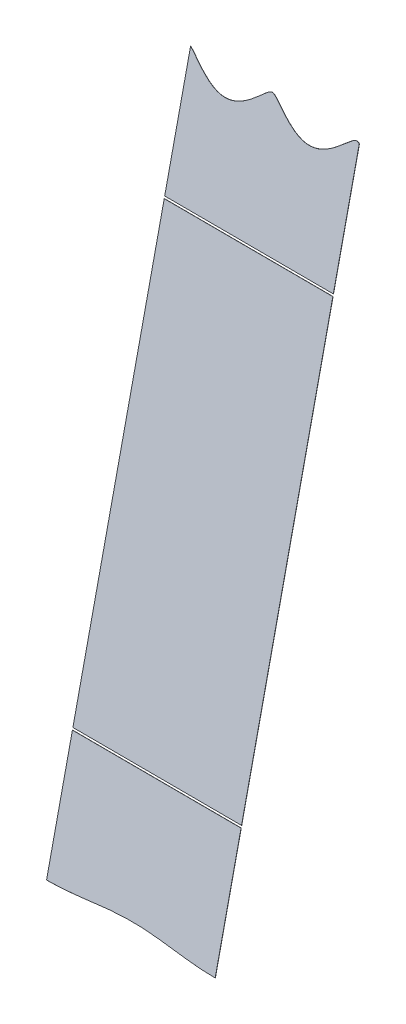
ISO-10303-21;
HEADER;
FILE_DESCRIPTION(('STEP AP214'),'2;1');
FILE_NAME('part.step','',(''),(''),'','','');
FILE_SCHEMA(('AUTOMOTIVE_DESIGN { 1 0 10303 214 1 1 1 1 }'));
ENDSEC;
DATA;
#1=APPLICATION_CONTEXT('core data for automotive mechanical design processes');
#2=APPLICATION_PROTOCOL_DEFINITION('international standard','automotive_design',2000,#1);
#3=PRODUCT_CONTEXT('',#1,'mechanical');
#4=PRODUCT('Part','Part','',(#3));
#5=PRODUCT_RELATED_PRODUCT_CATEGORY('part','',(#4));
#6=PRODUCT_DEFINITION_FORMATION('','',#4);
#7=PRODUCT_DEFINITION_CONTEXT('part definition',#1,'design');
#8=PRODUCT_DEFINITION('design','',#6,#7);
#9=PRODUCT_DEFINITION_SHAPE('','',#8);
#10=(LENGTH_UNIT() NAMED_UNIT(*) SI_UNIT(.MILLI.,.METRE.));
#11=(NAMED_UNIT(*) PLANE_ANGLE_UNIT() SI_UNIT($,.RADIAN.));
#12=(NAMED_UNIT(*) SI_UNIT($,.STERADIAN.) SOLID_ANGLE_UNIT());
#13=UNCERTAINTY_MEASURE_WITH_UNIT(LENGTH_MEASURE(1.E-05),#10,'distance_accuracy_value','');
#14=(GEOMETRIC_REPRESENTATION_CONTEXT(3) GLOBAL_UNCERTAINTY_ASSIGNED_CONTEXT((#13)) GLOBAL_UNIT_ASSIGNED_CONTEXT((#10,
#11,#12)) REPRESENTATION_CONTEXT('',''));
#15=CARTESIAN_POINT('',(0.,0.,0.));
#16=DIRECTION('',(0.,0.,1.));
#17=DIRECTION('',(1.,0.,0.));
#18=AXIS2_PLACEMENT_3D('',#15,#16,#17);
#19=CARTESIAN_POINT('',(4203.15583982929,-2777.77441756719,1018.08170440658));
#20=DIRECTION('',(-0.00396825396824498,0.216307580433428,0.976317204400025));
#21=DIRECTION('',(0.,-0.976324891543631,0.216309283555555));
#22=AXIS2_PLACEMENT_3D('',#19,#20,#21);
#23=PLANE('',#22);
#24=DIRECTION('',(0.999992126449225,0.000858370172837925,0.00387430512516479));
#25=VECTOR('',#24,1.);
#26=CARTESIAN_POINT('',(1000.56833114507,323.564899174338,317.948713594979));
#27=LINE('',#26,#25);
#28=CARTESIAN_POINT('',(1000.56833114507,323.564899174338,317.948713594979));
#29=VERTEX_POINT('',#28);
#30=CARTESIAN_POINT('',(1079.9496031746,323.633038227026,318.256263285554));
#31=VERTEX_POINT('',#30);
#32=EDGE_CURVE('E14',#29,#31,#27,.T.);
#33=ORIENTED_EDGE('',*,*,#32,.F.);
#34=DIRECTION('',(0.,0.976324891543631,-0.216309283555555));
#35=VECTOR('',#34,1.);
#36=CARTESIAN_POINT('',(1000.56833114507,268.76455418902,330.089982823126));
#37=LINE('',#36,#35);
#38=CARTESIAN_POINT('',(1000.56833114507,268.76455418902,330.089982823126));
#39=VERTEX_POINT('',#38);
#40=EDGE_CURVE('E112',#39,#29,#37,.T.);
#41=ORIENTED_EDGE('',*,*,#40,.F.);
#42=CARTESIAN_POINT('',(1000.56833114507,268.76455418902,330.089982823125));
#43=CARTESIAN_POINT('',(1001.80451108967,268.766137941085,330.094656405003));
#44=CARTESIAN_POINT('',(1004.27681417362,268.820556080355,330.092648523236));
#45=CARTESIAN_POINT('',(1006.74808644245,268.924179126641,330.079734877573));
#46=CARTESIAN_POINT('',(1008.62287459543,269.037184915164,330.062318024643));
#47=CARTESIAN_POINT('',(1009.86153110381,269.12220138551,330.048516768932));
#48=CARTESIAN_POINT('',(1011.09985735074,269.216740678427,330.032604345599));
#49=CARTESIAN_POINT('',(1012.33769195354,269.319886536673,330.014783099721));
#50=CARTESIAN_POINT('',(1013.5747575011,269.430627012192,329.995276105517));
#51=CARTESIAN_POINT('',(1014.81053089588,269.547850016306,329.974327625227));
#52=CARTESIAN_POINT('',(1016.04389008025,269.670315619974,329.952207810232));
#53=CARTESIAN_POINT('',(1017.27190545426,269.796537301001,329.929234098984));
#54=CARTESIAN_POINT('',(1017.93298440153,269.86614673832,329.916498771009));
#55=CARTESIAN_POINT('',(1018.48373287821,269.924138740219,329.905888899811));
#56=CARTESIAN_POINT('',(1019.44800225942,270.027127587642,329.886990531006));
#57=CARTESIAN_POINT('',(1019.79348296472,270.064155553608,329.880191025152));
#58=CARTESIAN_POINT('',(1019.99108662077,270.085334338236,329.876301930347));
#59=CARTESIAN_POINT('',(1020.81929925612,270.174197957099,329.859980066678));
#60=CARTESIAN_POINT('',(1021.03381534018,270.197184952217,329.855759095282));
#61=CARTESIAN_POINT('',(1021.3773364207,270.23399579293,329.848999729609));
#62=CARTESIAN_POINT('',(1022.34159633172,270.336943838154,329.830110362227));
#63=CARTESIAN_POINT('',(1022.89431390338,270.395097781947,329.819472615468));
#64=CARTESIAN_POINT('',(1023.55461173951,270.464570737428,329.806764350837));
#65=CARTESIAN_POINT('',(1024.78295420149,270.590675916015,329.783817780696));
#66=CARTESIAN_POINT('',(1026.0164477646,270.712956120907,329.761739587838));
#67=CARTESIAN_POINT('',(1027.25228917246,270.829940287584,329.740844299524));
#68=CARTESIAN_POINT('',(1028.48939363135,270.940394847723,329.721400809347));
#69=CARTESIAN_POINT('',(1029.72725231253,271.04321203544,329.703652479808));
#70=CARTESIAN_POINT('',(1030.96559450374,271.137383799183,329.687821549065));
#71=CARTESIAN_POINT('',(1032.20426200112,271.221997772257,329.674109513147));
#72=CARTESIAN_POINT('',(1034.07890567396,271.334338345117,329.656839454573));
#73=CARTESIAN_POINT('',(1036.55020914601,271.437000848378,329.644138748475));
#74=CARTESIAN_POINT('',(1039.02257540382,271.490398568754,329.642357201992));
#75=CARTESIAN_POINT('',(1041.49525979722,271.492522098307,329.651936982083));
#76=CARTESIAN_POINT('',(1043.96762612984,271.443370850032,329.672875632972));
#77=CARTESIAN_POINT('',(1046.43892970556,271.344952870979,329.704725235745));
#78=CARTESIAN_POINT('',(1048.3135730603,271.235831922349,329.736520997578));
#79=CARTESIAN_POINT('',(1049.55224050005,271.153345241628,329.759830882117));
#80=CARTESIAN_POINT('',(1050.79058274073,271.061300137031,329.785257157783));
#81=CARTESIAN_POINT('',(1052.02844161448,270.960608689617,329.812597105935));
#82=CARTESIAN_POINT('',(1053.26554607168,270.852278508502,329.841626384441));
#83=CARTESIAN_POINT('',(1054.50138753325,270.737416461405,329.872097694524));
#84=CARTESIAN_POINT('',(1055.73488141363,270.617254226591,329.903733743872));
#85=CARTESIAN_POINT('',(1056.9632244239,270.493258054187,329.936198284001));
#86=CARTESIAN_POINT('',(1057.6236204163,270.424908617498,329.954025605094));
#87=CARTESIAN_POINT('',(1058.17624196949,270.367713582552,329.968943566416));
#88=CARTESIAN_POINT('',(1059.14050184601,270.266421018689,329.99530464801));
#89=CARTESIAN_POINT('',(1059.48411897949,270.230189805863,330.004728476654));
#90=CARTESIAN_POINT('',(1059.69856399563,270.207578584645,330.010609711577));
#91=CARTESIAN_POINT('',(1060.52678791247,270.120135613342,330.033349432124));
#92=CARTESIAN_POINT('',(1060.72445135495,270.09928975265,330.038771334354));
#93=CARTESIAN_POINT('',(1061.06983660923,270.062864944878,330.048245241401));
#94=CARTESIAN_POINT('',(1062.03410575727,269.961531457687,330.074615427431));
#95=CARTESIAN_POINT('',(1062.58494991814,269.904474955457,330.089495471957));
#96=CARTESIAN_POINT('',(1063.24593076006,269.836010482999,330.107350656884));
#97=CARTESIAN_POINT('',(1064.473945407,269.711896779526,330.139839901926));
#98=CARTESIAN_POINT('',(1065.70730433606,269.591548181748,330.171516692337));
#99=CARTESIAN_POINT('',(1066.94307769533,269.476446214516,330.20204088103));
#100=CARTESIAN_POINT('',(1068.18014315778,269.36782891112,330.231133614307));
#101=CARTESIAN_POINT('',(1069.41797771056,269.266807459309,330.258546577603));
#102=CARTESIAN_POINT('',(1070.65630394372,269.17439333863,330.284054545422));
#103=CARTESIAN_POINT('',(1071.89496043202,269.091502538919,330.307453919875));
#104=CARTESIAN_POINT('',(1073.76974891639,268.981713979889,330.339398183752));
#105=CARTESIAN_POINT('',(1076.24102112307,268.882331596532,330.371461327248));
#106=CARTESIAN_POINT('',(1078.71337402659,268.832154755645,330.392627148329));
#107=CARTESIAN_POINT('',(1079.9496031746,268.832693241708,330.397532513699));
#108=B_SPLINE_CURVE_WITH_KNOTS('',2,(#42,#43,#44,#45,#46,#47,#48,#49,#50,#51,#52,#53,#54,#55,
#56,#57,#58,#59,#60,#61,#62,#63,#64,#65,#66,#67,#68,#69,#70,#71,#72,#73,#74,#75,#76,#77,#78,#79,
#80,#81,#82,#83,#84,#85,#86,#87,#88,#89,#90,#91,#92,#93,#94,#95,#96,#97,#98,#99,#100,#101,#102,
#103,#104,#105,#106,#107),.UNSPECIFIED.,.F.,.F.,(3,1,1,1,1,1,1,1,1,1,1,2,1,2,1,2,1,2,1,1,1,1,1,
1,1,1,1,1,1,1,1,1,1,1,1,1,1,1,1,2,1,2,1,2,1,2,1,1,1,1,1,1,1,1,1,1,3),(0.,0.03125,0.0625,0.09375,
0.109375,0.125,0.140625,0.15625,0.171875,0.1875,0.203125,0.21875,0.234375,0.2421875,0.25,
0.2578125,0.265625,0.28125,0.296875,0.3125,0.328125,0.34375,0.359375,0.375,0.390625,0.40625,
0.4375,0.46875,0.5,0.53125,0.5625,0.59375,0.609375,0.625,0.640625,0.65625,0.671875,0.6875,
0.703125,0.71875,0.734375,0.7421875,0.75,0.7578125,0.765625,0.78125,0.796875,0.8125,0.828125,
0.84375,0.859375,0.875,0.890625,0.90625,0.9375,0.96875,1.),.UNSPECIFIED.);
#109=CARTESIAN_POINT('',(1079.9496031746,268.832693241708,330.3975325137));
#110=VERTEX_POINT('',#109);
#111=EDGE_CURVE('E106',#39,#110,#108,.T.);
#112=ORIENTED_EDGE('',*,*,#111,.T.);
#113=DIRECTION('',(0.,0.976324891543631,-0.216309283555555));
#114=VECTOR('',#113,1.);
#115=CARTESIAN_POINT('',(1079.9496031746,268.832693241708,330.3975325137));
#116=LINE('',#115,#114);
#117=EDGE_CURVE('E100',#110,#31,#116,.T.);
#118=ORIENTED_EDGE('',*,*,#117,.T.);
#119=EDGE_LOOP('',(#33,#41,#112,#118));
#120=FACE_BOUND('',#119,.T.);
#121=ADVANCED_FACE('F53',(#120),#23,.T.);
#122=CARTESIAN_POINT('',(4203.15623665469,-2777.79604832523,1017.98407268614));
#123=DIRECTION('',(-0.00396825396824498,0.216307580433428,0.976317204400025));
#124=DIRECTION('',(0.,-0.976324891543631,0.216309283555555));
#125=AXIS2_PLACEMENT_3D('',#122,#123,#124);
#126=PLANE('',#125);
#127=DIRECTION('',(0.,0.976324891543631,-0.216309283555555));
#128=VECTOR('',#127,1.);
#129=CARTESIAN_POINT('',(1000.56872797047,268.742923430977,329.992351102686));
#130=LINE('',#129,#128);
#131=CARTESIAN_POINT('',(1000.56872797047,268.742923430977,329.992351102686));
#132=VERTEX_POINT('',#131);
#133=CARTESIAN_POINT('',(1000.56872797047,323.543268416294,317.85108187454));
#134=VERTEX_POINT('',#133);
#135=EDGE_CURVE('E56',#132,#134,#130,.T.);
#136=ORIENTED_EDGE('',*,*,#135,.T.);
#137=DIRECTION('',(0.999992126449225,0.000858370172837819,0.00387430512516431));
#138=VECTOR('',#137,1.);
#139=CARTESIAN_POINT('',(4203.15623665469,326.292295654258,330.258980767444));
#140=LINE('',#139,#138);
#141=CARTESIAN_POINT('',(1079.95,323.611407468991,318.15863156515));
#142=VERTEX_POINT('',#141);
#143=EDGE_CURVE('E71',#134,#142,#140,.T.);
#144=ORIENTED_EDGE('',*,*,#143,.T.);
#145=DIRECTION('',(0.,0.976324891543631,-0.216309283555555));
#146=VECTOR('',#145,1.);
#147=CARTESIAN_POINT('',(1079.95,268.811062483665,330.29990079326));
#148=LINE('',#147,#146);
#149=CARTESIAN_POINT('',(1079.95,268.811062483665,330.29990079326));
#150=VERTEX_POINT('',#149);
#151=EDGE_CURVE('E102',#150,#142,#148,.T.);
#152=ORIENTED_EDGE('',*,*,#151,.F.);
#153=CARTESIAN_POINT('',(1000.56872797047,268.742923430977,329.992351102685));
#154=CARTESIAN_POINT('',(1001.80490791507,268.744507183042,329.997024684563));
#155=CARTESIAN_POINT('',(1004.27721099901,268.798925322312,329.995016802796));
#156=CARTESIAN_POINT('',(1006.74848326784,268.902548368597,329.982103157133));
#157=CARTESIAN_POINT('',(1008.62327142083,269.015554157121,329.964686304203));
#158=CARTESIAN_POINT('',(1009.86192792921,269.100570627467,329.950885048492));
#159=CARTESIAN_POINT('',(1011.10025417613,269.195109920383,329.934972625159));
#160=CARTESIAN_POINT('',(1012.33808877894,269.29825577863,329.917151379281));
#161=CARTESIAN_POINT('',(1013.5751543265,269.408996254149,329.897644385077));
#162=CARTESIAN_POINT('',(1014.81092772128,269.526219258263,329.876695904787));
#163=CARTESIAN_POINT('',(1016.04428690564,269.648684861931,329.854576089792));
#164=CARTESIAN_POINT('',(1017.27230227966,269.774906542958,329.831602378544));
#165=CARTESIAN_POINT('',(1017.93338122693,269.844515980276,329.818867050569));
#166=CARTESIAN_POINT('',(1018.48412970361,269.902507982176,329.808257179371));
#167=CARTESIAN_POINT('',(1019.44839908481,270.005496829599,329.789358810566));
#168=CARTESIAN_POINT('',(1019.79387979012,270.042524795565,329.782559304712));
#169=CARTESIAN_POINT('',(1019.99148344617,270.063703580193,329.778670209907));
#170=CARTESIAN_POINT('',(1020.81969608152,270.152567199056,329.762348346238));
#171=CARTESIAN_POINT('',(1021.03421216558,270.175554194174,329.758127374842));
#172=CARTESIAN_POINT('',(1021.3777332461,270.212365034887,329.751368009169));
#173=CARTESIAN_POINT('',(1022.34199315712,270.315313080111,329.732478641787));
#174=CARTESIAN_POINT('',(1022.89471072877,270.373467023903,329.721840895028));
#175=CARTESIAN_POINT('',(1023.55500856491,270.442939979385,329.709132630397));
#176=CARTESIAN_POINT('',(1024.78335102689,270.569045157971,329.686186060256));
#177=CARTESIAN_POINT('',(1026.01684458999,270.691325362863,329.664107867398));
#178=CARTESIAN_POINT('',(1027.25268599786,270.80830952954,329.643212579084));
#179=CARTESIAN_POINT('',(1028.48979045675,270.91876408968,329.623769088907));
#180=CARTESIAN_POINT('',(1029.72764913793,271.021581277396,329.606020759368));
#181=CARTESIAN_POINT('',(1030.96599132914,271.11575304114,329.590189828625));
#182=CARTESIAN_POINT('',(1032.20465882652,271.200367014214,329.576477792706));
#183=CARTESIAN_POINT('',(1034.07930249935,271.312707587073,329.559207734133));
#184=CARTESIAN_POINT('',(1036.5506059714,271.415370090335,329.546507028035));
#185=CARTESIAN_POINT('',(1039.02297222922,271.46876781071,329.544725481552));
#186=CARTESIAN_POINT('',(1041.49565662262,271.470891340264,329.554305261643));
#187=CARTESIAN_POINT('',(1043.96802295524,271.421740091989,329.575243912532));
#188=CARTESIAN_POINT('',(1046.43932653096,271.323322112935,329.607093515305));
#189=CARTESIAN_POINT('',(1048.3139698857,271.214201164306,329.638889277138));
#190=CARTESIAN_POINT('',(1049.55263732545,271.131714483585,329.662199161677));
#191=CARTESIAN_POINT('',(1050.79097956613,271.039669378988,329.687625437343));
#192=CARTESIAN_POINT('',(1052.02883843988,270.938977931574,329.714965385495));
#193=CARTESIAN_POINT('',(1053.26594289708,270.830647750459,329.743994664001));
#194=CARTESIAN_POINT('',(1054.50178435864,270.715785703362,329.774465974084));
#195=CARTESIAN_POINT('',(1055.73527823902,270.595623468547,329.806102023432));
#196=CARTESIAN_POINT('',(1056.9636212493,270.471627296144,329.838566563561));
#197=CARTESIAN_POINT('',(1057.62401724169,270.403277859455,329.856393884654));
#198=CARTESIAN_POINT('',(1058.17663879489,270.346082824508,329.871311845976));
#199=CARTESIAN_POINT('',(1059.14089867141,270.244790260646,329.89767292757));
#200=CARTESIAN_POINT('',(1059.48451580489,270.20855904782,329.907096756214));
#201=CARTESIAN_POINT('',(1059.69896082103,270.185947826601,329.912977991137));
#202=CARTESIAN_POINT('',(1060.52718473787,270.098504855298,329.935717711684));
#203=CARTESIAN_POINT('',(1060.72484818035,270.077658994607,329.941139613914));
#204=CARTESIAN_POINT('',(1061.07023343463,270.041234186834,329.950613520961));
#205=CARTESIAN_POINT('',(1062.03450258267,269.939900699643,329.976983706991));
#206=CARTESIAN_POINT('',(1062.58534674354,269.882844197413,329.991863751517));
#207=CARTESIAN_POINT('',(1063.24632758546,269.814379724955,330.009718936444));
#208=CARTESIAN_POINT('',(1064.47434223239,269.690266021483,330.042208181486));
#209=CARTESIAN_POINT('',(1065.70770116146,269.569917423705,330.073884971897));
#210=CARTESIAN_POINT('',(1066.94347452073,269.454815456472,330.10440916059));
#211=CARTESIAN_POINT('',(1068.18053998318,269.346198153077,330.133501893867));
#212=CARTESIAN_POINT('',(1069.41837453596,269.245176701266,330.160914857163));
#213=CARTESIAN_POINT('',(1070.65670076911,269.152762580587,330.186422824981));
#214=CARTESIAN_POINT('',(1071.89535725742,269.069871780876,330.209822199434));
#215=CARTESIAN_POINT('',(1073.77014574178,268.960083221845,330.241766463312));
#216=CARTESIAN_POINT('',(1076.24141794847,268.860700838489,330.273829606808));
#217=CARTESIAN_POINT('',(1078.71377085199,268.810523997602,330.294995427889));
#218=CARTESIAN_POINT('',(1079.95,268.811062483665,330.299900793259));
#219=B_SPLINE_CURVE_WITH_KNOTS('',2,(#153,#154,#155,#156,#157,#158,#159,#160,#161,#162,#163,
#164,#165,#166,#167,#168,#169,#170,#171,#172,#173,#174,#175,#176,#177,#178,#179,#180,#181,#182,
#183,#184,#185,#186,#187,#188,#189,#190,#191,#192,#193,#194,#195,#196,#197,#198,#199,#200,#201,
#202,#203,#204,#205,#206,#207,#208,#209,#210,#211,#212,#213,#214,#215,#216,#217,#218),
.UNSPECIFIED.,.F.,.F.,(3,1,1,1,1,1,1,1,1,1,1,2,1,2,1,2,1,2,1,1,1,1,1,1,1,1,1,1,1,1,1,1,1,1,1,1,
1,1,1,2,1,2,1,2,1,2,1,1,1,1,1,1,1,1,1,1,3),(0.,0.03125,0.0625,0.09375,0.109375,0.125,0.140625,
0.15625,0.171875,0.1875,0.203125,0.21875,0.234375,0.2421875,0.25,0.2578125,0.265625,0.28125,
0.296875,0.3125,0.328125,0.34375,0.359375,0.375,0.390625,0.40625,0.4375,0.46875,0.5,0.53125,
0.5625,0.59375,0.609375,0.625,0.640625,0.65625,0.671875,0.6875,0.703125,0.71875,0.734375,
0.7421875,0.75,0.7578125,0.765625,0.78125,0.796875,0.8125,0.828125,0.84375,0.859375,0.875,
0.890625,0.90625,0.9375,0.96875,1.),.UNSPECIFIED.);
#220=EDGE_CURVE('E113',#132,#150,#219,.T.);
#221=ORIENTED_EDGE('',*,*,#220,.F.);
#222=EDGE_LOOP('',(#136,#144,#152,#221));
#223=FACE_BOUND('',#222,.T.);
#224=ADVANCED_FACE('F138',(#223),#126,.F.);
#225=CARTESIAN_POINT('',(1079.9496031746,268.832693241708,330.3975325137));
#226=DIRECTION('',(-0.999992126449225,-0.000858370172840623,-0.00387430512518148));
#227=DIRECTION('',(-0.00387430655247502,0.,0.999992494846205));
#228=AXIS2_PLACEMENT_3D('',#225,#226,#227);
#229=PLANE('',#228);
#230=ORIENTED_EDGE('',*,*,#151,.T.);
#231=DIRECTION('',(-0.00396825396824498,0.216307580433428,0.976317204400025));
#232=VECTOR('',#231,1.);
#233=CARTESIAN_POINT('',(1079.98928571429,321.469962422692,308.493091241553));
#234=LINE('',#233,#232);
#235=EDGE_CURVE('E90',#142,#31,#234,.T.);
#236=ORIENTED_EDGE('',*,*,#235,.T.);
#237=ORIENTED_EDGE('',*,*,#117,.F.);
#238=DIRECTION('',(0.00396825396826235,-0.216307580433427,-0.976317204400025));
#239=VECTOR('',#238,1.);
#240=CARTESIAN_POINT('',(1079.9496031746,268.832693241708,330.3975325137));
#241=LINE('',#240,#239);
#242=EDGE_CURVE('E103',#110,#150,#241,.T.);
#243=ORIENTED_EDGE('',*,*,#242,.T.);
#244=EDGE_LOOP('',(#230,#236,#237,#243));
#245=FACE_BOUND('',#244,.T.);
#246=ADVANCED_FACE('F98',(#245),#229,.F.);
#247=CARTESIAN_POINT('',(1000.56833114507,268.76455418902,330.089982823126));
#248=DIRECTION('',(-0.999992126449225,-0.000858370172842012,-0.00387430512518117));
#249=DIRECTION('',(-0.00387430655247472,0.,0.999992494846205));
#250=AXIS2_PLACEMENT_3D('',#247,#248,#249);
#251=PLANE('',#250);
#252=DIRECTION('',(-0.00396825396826235,0.216307580433428,0.976317204400025));
#253=VECTOR('',#252,1.);
#254=CARTESIAN_POINT('',(1000.56833114507,323.564899174338,317.94871359498));
#255=LINE('',#254,#253);
#256=EDGE_CURVE('E62',#134,#29,#255,.T.);
#257=ORIENTED_EDGE('',*,*,#256,.F.);
#258=ORIENTED_EDGE('',*,*,#135,.F.);
#259=DIRECTION('',(0.00396825396826235,-0.216307580433427,-0.976317204400025));
#260=VECTOR('',#259,1.);
#261=CARTESIAN_POINT('',(1000.56833114507,268.76455418902,330.089982823126));
#262=LINE('',#261,#260);
#263=EDGE_CURVE('E145',#39,#132,#262,.T.);
#264=ORIENTED_EDGE('',*,*,#263,.F.);
#265=ORIENTED_EDGE('',*,*,#40,.T.);
#266=EDGE_LOOP('',(#257,#258,#264,#265));
#267=FACE_BOUND('',#266,.T.);
#268=ADVANCED_FACE('F130',(#267),#251,.T.);
#269=DIRECTION('',(0.00396825396826235,-0.216307580433427,-0.976317204400025));
#270=VECTOR('',#269,1.);
#271=SURFACE_OF_LINEAR_EXTRUSION('',#108,#270);
#272=ORIENTED_EDGE('',*,*,#220,.T.);
#273=ORIENTED_EDGE('',*,*,#242,.F.);
#274=ORIENTED_EDGE('',*,*,#111,.F.);
#275=ORIENTED_EDGE('',*,*,#263,.T.);
#276=EDGE_LOOP('',(#272,#273,#274,#275));
#277=FACE_BOUND('',#276,.T.);
#278=ADVANCED_FACE('F127',(#277),#271,.F.);
#279=CARTESIAN_POINT('',(1000.60801368475,321.401823370003,308.185541550979));
#280=DIRECTION('',(0.,-0.976324891543631,0.216309283555555));
#281=DIRECTION('',(0.,-0.216309283555555,-0.976324891543631));
#282=AXIS2_PLACEMENT_3D('',#279,#280,#281);
#283=PLANE('',#282);
#284=ORIENTED_EDGE('',*,*,#256,.T.);
#285=ORIENTED_EDGE('',*,*,#32,.T.);
#286=ORIENTED_EDGE('',*,*,#235,.F.);
#287=ORIENTED_EDGE('',*,*,#143,.F.);
#288=EDGE_LOOP('',(#284,#285,#286,#287));
#289=FACE_BOUND('',#288,.T.);
#290=ADVANCED_FACE('F89',(#289),#283,.F.);
#291=CLOSED_SHELL('',(#121,#224,#246,#268,#278,#290));
#292=MANIFOLD_SOLID_BREP('B2',#291);
#293=CARTESIAN_POINT('',(1000.56833114507,268.76455418902,330.089982823126));
#294=DIRECTION('',(-0.999992126449225,-0.000858370172842012,-0.00387430512518117));
#295=DIRECTION('',(-0.00387430655247472,0.,0.999992494846205));
#296=AXIS2_PLACEMENT_3D('',#293,#294,#295);
#297=PLANE('',#296);
#298=DIRECTION('',(-0.00396825396824498,0.216307580433428,0.976317204400025));
#299=VECTOR('',#298,1.);
#300=CARTESIAN_POINT('',(1000.60801368475,516.666801678729,264.923684839868));
#301=LINE('',#300,#299);
#302=CARTESIAN_POINT('',(1000.56872797047,518.808246725021,274.589225163429));
#303=VERTEX_POINT('',#302);
#304=CARTESIAN_POINT('',(1000.56833114507,518.829877483064,274.686856883869));
#305=VERTEX_POINT('',#304);
#306=EDGE_CURVE('E244',#303,#305,#301,.T.);
#307=ORIENTED_EDGE('',*,*,#306,.T.);
#308=DIRECTION('',(0.,0.976324891543631,-0.216309283555555));
#309=VECTOR('',#308,1.);
#310=CARTESIAN_POINT('',(1000.56833114507,268.76455418902,330.089982823126));
#311=LINE('',#310,#309);
#312=CARTESIAN_POINT('',(1000.56833114507,573.630222468382,262.545587655723));
#313=VERTEX_POINT('',#312);
#314=EDGE_CURVE('E240',#305,#313,#311,.T.);
#315=ORIENTED_EDGE('',*,*,#314,.T.);
#316=DIRECTION('',(0.00396825396826235,-0.216307580433427,-0.976317204400025));
#317=VECTOR('',#316,1.);
#318=CARTESIAN_POINT('',(1000.56833114507,573.630222468382,262.545587655723));
#319=LINE('',#318,#317);
#320=CARTESIAN_POINT('',(1000.56872797047,573.608591710338,262.447955935283));
#321=VERTEX_POINT('',#320);
#322=EDGE_CURVE('E242',#313,#321,#319,.T.);
#323=ORIENTED_EDGE('',*,*,#322,.T.);
#324=DIRECTION('',(0.,0.976324891543631,-0.216309283555555));
#325=VECTOR('',#324,1.);
#326=CARTESIAN_POINT('',(1000.56872797047,268.742923430977,329.992351102686));
#327=LINE('',#326,#325);
#328=EDGE_CURVE('E201',#303,#321,#327,.T.);
#329=ORIENTED_EDGE('',*,*,#328,.F.);
#330=EDGE_LOOP('',(#307,#315,#323,#329));
#331=FACE_BOUND('',#330,.T.);
#332=ADVANCED_FACE('F198',(#331),#297,.T.);
#333=CARTESIAN_POINT('',(1079.9496031746,268.832693241708,330.3975325137));
#334=DIRECTION('',(-0.999992126449225,-0.000858370172840623,-0.00387430512518148));
#335=DIRECTION('',(-0.00387430655247502,0.,0.999992494846205));
#336=AXIS2_PLACEMENT_3D('',#333,#334,#335);
#337=PLANE('',#336);
#338=DIRECTION('',(0.,0.976324891543631,-0.216309283555555));
#339=VECTOR('',#338,1.);
#340=CARTESIAN_POINT('',(1079.9496031746,268.832693241708,330.3975325137));
#341=LINE('',#340,#339);
#342=CARTESIAN_POINT('',(1079.9496031746,518.898016535752,274.994406574443));
#343=VERTEX_POINT('',#342);
#344=CARTESIAN_POINT('',(1079.9496031746,573.761493141126,262.839150244645));
#345=VERTEX_POINT('',#344);
#346=EDGE_CURVE('E258',#343,#345,#341,.T.);
#347=ORIENTED_EDGE('',*,*,#346,.F.);
#348=DIRECTION('',(-0.00396825396824498,0.216307580433428,0.976317204400025));
#349=VECTOR('',#348,1.);
#350=CARTESIAN_POINT('',(1079.98928571429,516.734940731418,265.231234530442));
#351=LINE('',#350,#349);
#352=CARTESIAN_POINT('',(1079.95,518.876385777709,274.896774854003));
#353=VERTEX_POINT('',#352);
#354=EDGE_CURVE('E207',#353,#343,#351,.T.);
#355=ORIENTED_EDGE('',*,*,#354,.F.);
#356=DIRECTION('',(0.,0.976324891543631,-0.216309283555555));
#357=VECTOR('',#356,1.);
#358=CARTESIAN_POINT('',(1079.95,268.811062483665,330.29990079326));
#359=LINE('',#358,#357);
#360=CARTESIAN_POINT('',(1079.95,573.739862383083,262.741518524205));
#361=VERTEX_POINT('',#360);
#362=EDGE_CURVE('E254',#353,#361,#359,.T.);
#363=ORIENTED_EDGE('',*,*,#362,.T.);
#364=DIRECTION('',(0.00396825396826235,-0.216307580433427,-0.976317204400025));
#365=VECTOR('',#364,1.);
#366=CARTESIAN_POINT('',(1079.9496031746,573.761493141126,262.839150244645));
#367=LINE('',#366,#365);
#368=EDGE_CURVE('E260',#345,#361,#367,.T.);
#369=ORIENTED_EDGE('',*,*,#368,.F.);
#370=EDGE_LOOP('',(#347,#355,#363,#369));
#371=FACE_BOUND('',#370,.T.);
#372=ADVANCED_FACE('F283',(#371),#337,.F.);
#373=CARTESIAN_POINT('',(4203.15583982929,-2777.77441756719,1018.08170440658));
#374=DIRECTION('',(-0.00396825396824498,0.216307580433428,0.976317204400025));
#375=DIRECTION('',(0.,-0.976324891543631,0.216309283555555));
#376=AXIS2_PLACEMENT_3D('',#373,#374,#375);
#377=PLANE('',#376);
#378=DIRECTION('',(-0.999992126449225,-0.000858370172837226,-0.00387430512516409));
#379=VECTOR('',#378,1.);
#380=CARTESIAN_POINT('',(1000.56833114507,518.829877483064,274.686856883869));
#381=LINE('',#380,#379);
#382=EDGE_CURVE('E51',#343,#305,#381,.T.);
#383=ORIENTED_EDGE('',*,*,#382,.F.);
#384=ORIENTED_EDGE('',*,*,#346,.T.);
#385=CARTESIAN_POINT('',(1000.56833114507,573.630222468382,262.545587655723));
#386=CARTESIAN_POINT('',(1000.83581871435,573.45884938545,262.584643359501));
#387=CARTESIAN_POINT('',(1001.41635312954,573.022989631584,262.683569688289));
#388=CARTESIAN_POINT('',(1001.72655396512,572.77204054975,262.740429430338));
#389=CARTESIAN_POINT('',(1002.15259517906,572.427377869315,262.818522687186));
#390=CARTESIAN_POINT('',(1002.82209324366,571.854700810702,262.948123114895));
#391=CARTESIAN_POINT('',(1003.02584584922,571.680414357896,262.98756523762));
#392=CARTESIAN_POINT('',(1003.3633734876,571.389867818325,263.053309049241));
#393=CARTESIAN_POINT('',(1003.81803446848,570.998491943725,263.141868155161));
#394=CARTESIAN_POINT('',(1003.90451317117,570.9241731488,263.158685320824));
#395=CARTESIAN_POINT('',(1004.53485760153,570.382462450189,263.28126586817));
#396=CARTESIAN_POINT('',(1004.99472563613,569.99512003004,263.368952507788));
#397=CARTESIAN_POINT('',(1005.58318741802,569.499464334025,263.481159124286));
#398=CARTESIAN_POINT('',(1006.6847930713,568.605754729029,263.683642100496));
#399=CARTESIAN_POINT('',(1007.22528516729,568.189740836609,263.778008734603));
#400=CARTESIAN_POINT('',(1008.43796708344,567.256346013715,263.989735624823));
#401=CARTESIAN_POINT('',(1009.5466714323,566.525869572087,264.156082393427));
#402=CARTESIAN_POINT('',(1010.82812431749,565.681576731845,264.348347848855));
#403=CARTESIAN_POINT('',(1012.03811150665,565.062878085765,264.49034139664));
#404=CARTESIAN_POINT('',(1013.39769391619,564.367687422962,264.649890135309));
#405=CARTESIAN_POINT('',(1014.70788893383,563.936002747191,264.750857171288));
#406=CARTESIAN_POINT('',(1016.13798270449,563.464813681897,264.861063917042));
#407=CARTESIAN_POINT('',(1018.99183636331,563.12338835439,264.948307798656));
#408=CARTESIAN_POINT('',(1021.85304862367,563.415001434388,264.895329009982));
#409=CARTESIAN_POINT('',(1023.28895874417,563.866712673095,264.80108657663));
#410=CARTESIAN_POINT('',(1024.60613108407,564.281071163054,264.714637205821));
#411=CARTESIAN_POINT('',(1025.96963842982,564.962846145494,264.569128806731));
#412=CARTESIAN_POINT('',(1027.18716701752,565.571629467482,264.439198714169));
#413=CARTESIAN_POINT('',(1028.47354886203,566.409931760793,264.258697489686));
#414=CARTESIAN_POINT('',(1029.59081076576,567.138022894952,264.101926665724));
#415=CARTESIAN_POINT('',(1030.80956581201,568.07233820212,263.899878445106));
#416=CARTESIAN_POINT('',(1031.35570380357,568.491015512968,263.809338340475));
#417=CARTESIAN_POINT('',(1032.46196227087,569.387283092976,263.615262525519));
#418=CARTESIAN_POINT('',(1033.04702349497,569.880224484031,263.508427075319));
#419=CARTESIAN_POINT('',(1033.5106697712,570.270868114042,263.423762673349));
#420=CARTESIAN_POINT('',(1034.13202876131,570.805819093123,263.30776733787));
#421=CARTESIAN_POINT('',(1034.2749149061,570.928835069834,263.281093343344));
#422=CARTESIAN_POINT('',(1035.01693213463,571.569194204683,263.142234761682));
#423=CARTESIAN_POINT('',(1035.21132598343,571.736020024705,263.106063848005));
#424=CARTESIAN_POINT('',(1035.88391187516,572.313222922924,262.98091561734));
#425=CARTESIAN_POINT('',(1036.30593518386,572.656205968411,262.906641460639));
#426=CARTESIAN_POINT('',(1036.61692253841,572.908948856709,262.851909119966));
#427=CARTESIAN_POINT('',(1037.19762581513,573.347068128846,262.757202050175));
#428=CARTESIAN_POINT('',(1037.81350588014,573.743419584202,262.671891809383));
#429=CARTESIAN_POINT('',(1038.28081353331,573.944051138725,262.629340340986));
#430=CARTESIAN_POINT('',(1038.6303514143,574.035850744574,262.610422416095));
#431=CARTESIAN_POINT('',(1038.98750289403,574.056311170789,262.607340961114));
#432=CARTESIAN_POINT('',(1039.34178626032,574.001627648383,262.620896337108));
#433=CARTESIAN_POINT('',(1039.8223135397,573.838232270242,262.659050446259));
#434=CARTESIAN_POINT('',(1040.45063752802,573.470935317533,262.742980611509));
#435=CARTESIAN_POINT('',(1041.04048992885,573.051531866516,262.838298843561));
#436=CARTESIAN_POINT('',(1041.35576377135,572.806507948806,262.893866457467));
#437=CARTESIAN_POINT('',(1041.78951408406,572.469406716163,262.970315774408));
#438=CARTESIAN_POINT('',(1042.4690238033,571.905594673065,263.097992809536));
#439=CARTESIAN_POINT('',(1042.68238605415,571.728560845342,263.138082684375));
#440=CARTESIAN_POINT('',(1043.29445632127,571.21672272784,263.253970547999));
#441=CARTESIAN_POINT('',(1044.17003617884,570.484424569231,263.419773388878));
#442=CARTESIAN_POINT('',(1044.66446464629,570.079667217183,263.511458858322));
#443=CARTESIAN_POINT('',(1045.251474574,569.599119272215,263.620312381803));
#444=CARTESIAN_POINT('',(1046.35391963928,568.730380414711,263.817266385515));
#445=CARTESIAN_POINT('',(1046.89688725526,568.325051028815,263.909275879698));
#446=CARTESIAN_POINT('',(1048.12933879157,567.405016740118,264.118123035811));
#447=CARTESIAN_POINT('',(1049.25610884556,566.690075378658,264.281101364033));
#448=CARTESIAN_POINT('',(1050.54088164033,565.874880470154,264.466933532271));
#449=CARTESIAN_POINT('',(1051.75604665326,565.282178808112,264.603188373648));
#450=CARTESIAN_POINT('',(1053.11832078705,564.6177240759,264.755938365656));
#451=CARTESIAN_POINT('',(1054.43358041446,564.212727544296,264.851013105354));
#452=CARTESIAN_POINT('',(1055.86081877257,563.773250369785,264.954182329556));
#453=CARTESIAN_POINT('',(1058.71041837455,563.481352972522,265.03043577908));
#454=CARTESIAN_POINT('',(1061.5609408841,563.803253034091,264.970703321292));
#455=CARTESIAN_POINT('',(1062.99015454171,564.257187725409,264.875941053897));
#456=CARTESIAN_POINT('',(1064.30493174483,564.674776082949,264.788766355962));
#457=CARTESIAN_POINT('',(1065.66869150683,565.351067073568,264.644473986507));
#458=CARTESIAN_POINT('',(1066.87886881549,565.951196241255,264.516431382383));
#459=CARTESIAN_POINT('',(1068.15982777572,566.771339253068,264.339931389101));
#460=CARTESIAN_POINT('',(1069.28479749985,567.491609055919,264.184924745707));
#461=CARTESIAN_POINT('',(1070.51654814976,568.415843759428,263.985162750133));
#462=CARTESIAN_POINT('',(1071.05967387157,568.823374001445,263.897080086613));
#463=CARTESIAN_POINT('',(1072.16364133664,569.696739484812,263.708069025008));
#464=CARTESIAN_POINT('',(1072.75168138182,570.17966895655,263.603463869175));
#465=CARTESIAN_POINT('',(1073.21258640052,570.558188445197,263.521474484776));
#466=CARTESIAN_POINT('',(1073.85111661485,571.093170351979,263.405542089787));
#467=CARTESIAN_POINT('',(1073.88176669167,571.11885000844,263.399977221072));
#468=CARTESIAN_POINT('',(1074.40172174869,571.555065768719,263.305444971186));
#469=CARTESIAN_POINT('',(1074.7417612228,571.84034153577,263.243622903868));
#470=CARTESIAN_POINT('',(1074.95299933163,572.016302998429,263.205496410136));
#471=CARTESIAN_POINT('',(1075.6342394955,572.583776435469,263.082538961879));
#472=CARTESIAN_POINT('',(1076.06868798449,572.924333881619,263.008852710207));
#473=CARTESIAN_POINT('',(1076.38400310743,573.171504526066,262.955372516135));
#474=CARTESIAN_POINT('',(1076.97121445987,573.595652188217,262.863787373147));
#475=CARTESIAN_POINT('',(1077.5916839317,573.971825046024,262.78296644743));
#476=CARTESIAN_POINT('',(1078.06372420829,574.153056824054,262.744732324817));
#477=CARTESIAN_POINT('',(1078.41428586489,574.227342721181,262.729698804034));
#478=CARTESIAN_POINT('',(1078.77125803778,574.229766785478,262.730612659444));
#479=CARTESIAN_POINT('',(1079.12289461753,574.158466719639,262.74783874939));
#480=CARTESIAN_POINT('',(1079.59672598925,573.978457303779,262.789646559636));
#481=CARTESIAN_POINT('',(1079.9496031746,573.761493141126,262.839150244644));
#482=B_SPLINE_CURVE_WITH_KNOTS('',2,(#385,#386,#387,#388,#389,#390,#391,#392,#393,#394,#395,
#396,#397,#398,#399,#400,#401,#402,#403,#404,#405,#406,#407,#408,#409,#410,#411,#412,#413,#414,
#415,#416,#417,#418,#419,#420,#421,#422,#423,#424,#425,#426,#427,#428,#429,#430,#431,#432,#433,
#434,#435,#436,#437,#438,#439,#440,#441,#442,#443,#444,#445,#446,#447,#448,#449,#450,#451,#452,
#453,#454,#455,#456,#457,#458,#459,#460,#461,#462,#463,#464,#465,#466,#467,#468,#469,#470,#471,
#472,#473,#474,#475,#476,#477,#478,#479,#480,#481),.UNSPECIFIED.,.F.,.F.,(3,1,2,2,2,2,2,1,2,2,2,
2,1,1,2,2,2,2,1,2,2,1,2,2,1,1,1,1,1,1,1,1,1,2,2,1,1,2,1,2,2,2,2,1,1,2,2,2,2,1,2,2,2,2,2,1,1,1,1,
1,1,1,3),(0.,0.0078125,0.015625,0.03125,0.0390625,0.046875,0.0625,0.078125,0.09375,0.125,
0.15625,0.1875,0.21875,0.25,0.28125,0.3125,0.34375,0.375,0.390625,0.40625,0.421875,0.4296875,
0.4375,0.453125,0.4609375,0.46875,0.4765625,0.48046875,0.484375,0.48828125,0.4921875,0.5,
0.5078125,0.515625,0.53125,0.5390625,0.546875,0.5625,0.578125,0.59375,0.625,0.65625,0.6875,
0.71875,0.75,0.78125,0.8125,0.84375,0.875,0.890625,0.90625,0.921875,0.9296875,0.9375,0.953125,
0.9609375,0.96875,0.9765625,0.98046875,0.984375,0.98828125,0.9921875,1.),.UNSPECIFIED.);
#483=EDGE_CURVE('E252',#313,#345,#482,.T.);
#484=ORIENTED_EDGE('',*,*,#483,.F.);
#485=ORIENTED_EDGE('',*,*,#314,.F.);
#486=EDGE_LOOP('',(#383,#384,#484,#485));
#487=FACE_BOUND('',#486,.T.);
#488=ADVANCED_FACE('F256',(#487),#377,.T.);
#489=CARTESIAN_POINT('',(4203.15623665469,-2777.79604832523,1017.98407268614));
#490=DIRECTION('',(-0.00396825396824498,0.216307580433428,0.976317204400025));
#491=DIRECTION('',(0.,-0.976324891543631,0.216309283555555));
#492=AXIS2_PLACEMENT_3D('',#489,#490,#491);
#493=PLANE('',#492);
#494=ORIENTED_EDGE('',*,*,#362,.F.);
#495=DIRECTION('',(-0.999992126449225,-0.0008583701728373,-0.00387430512516442));
#496=VECTOR('',#495,1.);
#497=CARTESIAN_POINT('',(4203.15623665469,521.557273962982,286.997124056333));
#498=LINE('',#497,#496);
#499=EDGE_CURVE('E216',#353,#303,#498,.T.);
#500=ORIENTED_EDGE('',*,*,#499,.T.);
#501=ORIENTED_EDGE('',*,*,#328,.T.);
#502=CARTESIAN_POINT('',(1000.56872797047,573.608591710338,262.447955935283));
#503=CARTESIAN_POINT('',(1000.83621553975,573.437218627406,262.487011639061));
#504=CARTESIAN_POINT('',(1001.41674995494,573.001358873541,262.585937967849));
#505=CARTESIAN_POINT('',(1001.72695079051,572.750409791707,262.642797709898));
#506=CARTESIAN_POINT('',(1002.15299200446,572.405747111272,262.720890966746));
#507=CARTESIAN_POINT('',(1002.82249006905,571.833070052659,262.850491394455));
#508=CARTESIAN_POINT('',(1003.02624267462,571.658783599853,262.88993351718));
#509=CARTESIAN_POINT('',(1003.363770313,571.368237060282,262.955677328801));
#510=CARTESIAN_POINT('',(1003.81843129388,570.976861185681,263.044236434721));
#511=CARTESIAN_POINT('',(1003.90490999657,570.902542390757,263.061053600384));
#512=CARTESIAN_POINT('',(1004.53525442693,570.360831692146,263.18363414773));
#513=CARTESIAN_POINT('',(1004.99512246152,569.973489271996,263.271320787348));
#514=CARTESIAN_POINT('',(1005.58358424342,569.477833575982,263.383527403846));
#515=CARTESIAN_POINT('',(1006.6851898967,568.584123970985,263.586010380056));
#516=CARTESIAN_POINT('',(1007.22568199268,568.168110078566,263.680377014163));
#517=CARTESIAN_POINT('',(1008.43836390883,567.234715255672,263.892103904383));
#518=CARTESIAN_POINT('',(1009.54706825769,566.504238814043,264.058450672987));
#519=CARTESIAN_POINT('',(1010.82852114288,565.659945973801,264.250716128415));
#520=CARTESIAN_POINT('',(1012.03850833205,565.041247327721,264.3927096762));
#521=CARTESIAN_POINT('',(1013.39809074159,564.346056664919,264.552258414869));
#522=CARTESIAN_POINT('',(1014.70828575922,563.914371989148,264.653225450848));
#523=CARTESIAN_POINT('',(1016.13837952989,563.443182923854,264.763432196602));
#524=CARTESIAN_POINT('',(1018.99223318871,563.101757596347,264.850676078216));
#525=CARTESIAN_POINT('',(1021.85344544907,563.393370676344,264.797697289542));
#526=CARTESIAN_POINT('',(1023.28935556957,563.845081915052,264.70345485619));
#527=CARTESIAN_POINT('',(1024.60652790946,564.259440405011,264.617005485381));
#528=CARTESIAN_POINT('',(1025.97003525522,564.94121538745,264.471497086291));
#529=CARTESIAN_POINT('',(1027.18756384292,565.549998709438,264.341566993729));
#530=CARTESIAN_POINT('',(1028.47394568742,566.38830100275,264.161065769245));
#531=CARTESIAN_POINT('',(1029.59120759115,567.116392136909,264.004294945284));
#532=CARTESIAN_POINT('',(1030.8099626374,568.050707444077,263.802246724666));
#533=CARTESIAN_POINT('',(1031.35610062897,568.469384754925,263.711706620035));
#534=CARTESIAN_POINT('',(1032.46235909627,569.365652334933,263.517630805079));
#535=CARTESIAN_POINT('',(1033.04742032037,569.858593725987,263.410795354879));
#536=CARTESIAN_POINT('',(1033.51106659659,570.249237355999,263.326130952908));
#537=CARTESIAN_POINT('',(1034.1324255867,570.78418833508,263.21013561743));
#538=CARTESIAN_POINT('',(1034.2753117315,570.907204311791,263.183461622904));
#539=CARTESIAN_POINT('',(1035.01732896002,571.54756344664,263.044603041241));
#540=CARTESIAN_POINT('',(1035.21172280882,571.714389266662,263.008432127565));
#541=CARTESIAN_POINT('',(1035.88430870056,572.291592164881,262.8832838969));
#542=CARTESIAN_POINT('',(1036.30633200926,572.634575210368,262.809009740199));
#543=CARTESIAN_POINT('',(1036.61731936381,572.887318098665,262.754277399526));
#544=CARTESIAN_POINT('',(1037.19802264052,573.325437370803,262.659570329735));
#545=CARTESIAN_POINT('',(1037.81390270554,573.721788826158,262.574260088943));
#546=CARTESIAN_POINT('',(1038.2812103587,573.922420380682,262.531708620546));
#547=CARTESIAN_POINT('',(1038.6307482397,574.014219986531,262.512790695655));
#548=CARTESIAN_POINT('',(1038.98789971943,574.034680412746,262.509709240674));
#549=CARTESIAN_POINT('',(1039.34218308572,573.97999689034,262.523264616668));
#550=CARTESIAN_POINT('',(1039.8227103651,573.816601512199,262.561418725819));
#551=CARTESIAN_POINT('',(1040.45103435342,573.449304559489,262.645348891069));
#552=CARTESIAN_POINT('',(1041.04088675425,573.029901108473,262.74066712312));
#553=CARTESIAN_POINT('',(1041.35616059675,572.784877190763,262.796234737027));
#554=CARTESIAN_POINT('',(1041.78991090946,572.44777595812,262.872684053968));
#555=CARTESIAN_POINT('',(1042.4694206287,571.883963915021,263.000361089096));
#556=CARTESIAN_POINT('',(1042.68278287955,571.706930087299,263.040450963935));
#557=CARTESIAN_POINT('',(1043.29485314667,571.195091969796,263.156338827559));
#558=CARTESIAN_POINT('',(1044.17043300424,570.462793811188,263.322141668438));
#559=CARTESIAN_POINT('',(1044.66486147169,570.058036459139,263.413827137882));
#560=CARTESIAN_POINT('',(1045.2518713994,569.577488514171,263.522680661363));
#561=CARTESIAN_POINT('',(1046.35431646467,568.708749656668,263.719634665075));
#562=CARTESIAN_POINT('',(1046.89728408066,568.303420270772,263.811644159258));
#563=CARTESIAN_POINT('',(1048.12973561697,567.383385982074,264.020491315371));
#564=CARTESIAN_POINT('',(1049.25650567095,566.668444620615,264.183469643593));
#565=CARTESIAN_POINT('',(1050.54127846573,565.85324971211,264.369301811831));
#566=CARTESIAN_POINT('',(1051.75644347865,565.260548050069,264.505556653208));
#567=CARTESIAN_POINT('',(1053.11871761244,564.596093317856,264.658306645216));
#568=CARTESIAN_POINT('',(1054.43397723986,564.191096786253,264.753381384914));
#569=CARTESIAN_POINT('',(1055.86121559796,563.751619611741,264.856550609116));
#570=CARTESIAN_POINT('',(1058.71081519995,563.459722214478,264.93280405864));
#571=CARTESIAN_POINT('',(1061.5613377095,563.781622276048,264.873071600852));
#572=CARTESIAN_POINT('',(1062.9905513671,564.235556967366,264.778309333457));
#573=CARTESIAN_POINT('',(1064.30532857023,564.653145324905,264.691134635522));
#574=CARTESIAN_POINT('',(1065.66908833223,565.329436315524,264.546842266067));
#575=CARTESIAN_POINT('',(1066.87926564088,565.929565483211,264.418799661943));
#576=CARTESIAN_POINT('',(1068.16022460112,566.749708495025,264.242299668661));
#577=CARTESIAN_POINT('',(1069.28519432525,567.469978297876,264.087293025266));
#578=CARTESIAN_POINT('',(1070.51694497516,568.394213001384,263.887531029693));
#579=CARTESIAN_POINT('',(1071.06007069697,568.801743243401,263.799448366173));
#580=CARTESIAN_POINT('',(1072.16403816204,569.675108726769,263.610437304568));
#581=CARTESIAN_POINT('',(1072.75207820722,570.158038198507,263.505832148735));
#582=CARTESIAN_POINT('',(1073.21298322592,570.536557687153,263.423842764336));
#583=CARTESIAN_POINT('',(1073.85151344024,571.071539593936,263.307910369347));
#584=CARTESIAN_POINT('',(1073.88216351707,571.097219250397,263.302345500632));
#585=CARTESIAN_POINT('',(1074.40211857409,571.533435010675,263.207813250746));
#586=CARTESIAN_POINT('',(1074.74215804819,571.818710777726,263.145991183428));
#587=CARTESIAN_POINT('',(1074.95339615703,571.994672240386,263.107864689696));
#588=CARTESIAN_POINT('',(1075.63463632089,572.562145677426,262.984907241439));
#589=CARTESIAN_POINT('',(1076.06908480988,572.902703123576,262.911220989767));
#590=CARTESIAN_POINT('',(1076.38439993283,573.149873768023,262.857740795695));
#591=CARTESIAN_POINT('',(1076.97161128527,573.574021430173,262.766155652707));
#592=CARTESIAN_POINT('',(1077.59208075709,573.950194287981,262.68533472699));
#593=CARTESIAN_POINT('',(1078.06412103369,574.131426066011,262.647100604377));
#594=CARTESIAN_POINT('',(1078.41468269028,574.205711963138,262.632067083594));
#595=CARTESIAN_POINT('',(1078.77165486318,574.208136027434,262.632980939004));
#596=CARTESIAN_POINT('',(1079.12329144292,574.136835961596,262.65020702895));
#597=CARTESIAN_POINT('',(1079.59712281464,573.956826545736,262.692014839196));
#598=CARTESIAN_POINT('',(1079.95,573.739862383083,262.741518524204));
#599=B_SPLINE_CURVE_WITH_KNOTS('',2,(#502,#503,#504,#505,#506,#507,#508,#509,#510,#511,#512,
#513,#514,#515,#516,#517,#518,#519,#520,#521,#522,#523,#524,#525,#526,#527,#528,#529,#530,#531,
#532,#533,#534,#535,#536,#537,#538,#539,#540,#541,#542,#543,#544,#545,#546,#547,#548,#549,#550,
#551,#552,#553,#554,#555,#556,#557,#558,#559,#560,#561,#562,#563,#564,#565,#566,#567,#568,#569,
#570,#571,#572,#573,#574,#575,#576,#577,#578,#579,#580,#581,#582,#583,#584,#585,#586,#587,#588,
#589,#590,#591,#592,#593,#594,#595,#596,#597,#598),.UNSPECIFIED.,.F.,.F.,(3,1,2,2,2,2,2,1,2,2,2,
2,1,1,2,2,2,2,1,2,2,1,2,2,1,1,1,1,1,1,1,1,1,2,2,1,1,2,1,2,2,2,2,1,1,2,2,2,2,1,2,2,2,2,2,1,1,1,1,
1,1,1,3),(0.,0.0078125,0.015625,0.03125,0.0390625,0.046875,0.0625,0.078125,0.09375,0.125,
0.15625,0.1875,0.21875,0.25,0.28125,0.3125,0.34375,0.375,0.390625,0.40625,0.421875,0.4296875,
0.4375,0.453125,0.4609375,0.46875,0.4765625,0.48046875,0.484375,0.48828125,0.4921875,0.5,
0.5078125,0.515625,0.53125,0.5390625,0.546875,0.5625,0.578125,0.59375,0.625,0.65625,0.6875,
0.71875,0.75,0.78125,0.8125,0.84375,0.875,0.890625,0.90625,0.921875,0.9296875,0.9375,0.953125,
0.9609375,0.96875,0.9765625,0.98046875,0.984375,0.98828125,0.9921875,1.),.UNSPECIFIED.);
#600=EDGE_CURVE('E253',#321,#361,#599,.T.);
#601=ORIENTED_EDGE('',*,*,#600,.T.);
#602=EDGE_LOOP('',(#494,#500,#501,#601));
#603=FACE_BOUND('',#602,.T.);
#604=ADVANCED_FACE('F278',(#603),#493,.F.);
#605=DIRECTION('',(0.00396825396826235,-0.216307580433427,-0.976317204400025));
#606=VECTOR('',#605,1.);
#607=SURFACE_OF_LINEAR_EXTRUSION('',#482,#606);
#608=ORIENTED_EDGE('',*,*,#600,.F.);
#609=ORIENTED_EDGE('',*,*,#322,.F.);
#610=ORIENTED_EDGE('',*,*,#483,.T.);
#611=ORIENTED_EDGE('',*,*,#368,.T.);
#612=EDGE_LOOP('',(#608,#609,#610,#611));
#613=FACE_BOUND('',#612,.T.);
#614=ADVANCED_FACE('F250',(#613),#607,.T.);
#615=CARTESIAN_POINT('',(1000.60801368475,516.666801678729,264.923684839868));
#616=DIRECTION('',(0.,0.976324891543631,-0.216309283555555));
#617=DIRECTION('',(0.,0.216309283555555,0.976324891543631));
#618=AXIS2_PLACEMENT_3D('',#615,#616,#617);
#619=PLANE('',#618);
#620=ORIENTED_EDGE('',*,*,#354,.T.);
#621=ORIENTED_EDGE('',*,*,#382,.T.);
#622=ORIENTED_EDGE('',*,*,#306,.F.);
#623=ORIENTED_EDGE('',*,*,#499,.F.);
#624=EDGE_LOOP('',(#620,#621,#622,#623));
#625=FACE_BOUND('',#624,.T.);
#626=ADVANCED_FACE('F277',(#625),#619,.F.);
#627=CLOSED_SHELL('',(#332,#372,#488,#604,#614,#626));
#628=MANIFOLD_SOLID_BREP('B8',#627);
#629=CARTESIAN_POINT('',(1000.60801368475,515.690476787186,265.139994123424));
#630=DIRECTION('',(0.,-0.976324891543631,0.216309283555555));
#631=DIRECTION('',(0.,-0.216309283555555,-0.976324891543631));
#632=AXIS2_PLACEMENT_3D('',#629,#630,#631);
#633=PLANE('',#632);
#634=DIRECTION('',(-0.00396825396824498,0.216307580433428,0.976317204400025));
#635=VECTOR('',#634,1.);
#636=CARTESIAN_POINT('',(1000.60801368475,515.690476787186,265.139994123424));
#637=LINE('',#636,#635);
#638=CARTESIAN_POINT('',(1000.56872797047,517.831921833477,274.805534446984));
#639=VERTEX_POINT('',#638);
#640=CARTESIAN_POINT('',(1000.56833114507,517.85355259152,274.903166167424));
#641=VERTEX_POINT('',#640);
#642=EDGE_CURVE('E399',#639,#641,#637,.T.);
#643=ORIENTED_EDGE('',*,*,#642,.T.);
#644=DIRECTION('',(0.999992126449225,0.000858370172835827,0.00387430512516409));
#645=VECTOR('',#644,1.);
#646=CARTESIAN_POINT('',(1000.56833114507,517.85355259152,274.903166167424));
#647=LINE('',#646,#645);
#648=CARTESIAN_POINT('',(1079.9496031746,517.921691644208,275.210715857998));
#649=VERTEX_POINT('',#648);
#650=EDGE_CURVE('E402',#641,#649,#647,.T.);
#651=ORIENTED_EDGE('',*,*,#650,.T.);
#652=DIRECTION('',(-0.00396825396824498,0.216307580433428,0.976317204400025));
#653=VECTOR('',#652,1.);
#654=CARTESIAN_POINT('',(1079.98928571429,515.758615839874,265.447543813998));
#655=LINE('',#654,#653);
#656=CARTESIAN_POINT('',(1079.95,517.900060886165,275.113084137559));
#657=VERTEX_POINT('',#656);
#658=EDGE_CURVE('E388',#657,#649,#655,.T.);
#659=ORIENTED_EDGE('',*,*,#658,.F.);
#660=DIRECTION('',(0.999992126449225,0.000858370172835967,0.00387430512516472));
#661=VECTOR('',#660,1.);
#662=CARTESIAN_POINT('',(4203.15623665469,520.580949071434,287.21343333989));
#663=LINE('',#662,#661);
#664=EDGE_CURVE('E342',#639,#657,#663,.T.);
#665=ORIENTED_EDGE('',*,*,#664,.F.);
#666=EDGE_LOOP('',(#643,#651,#659,#665));
#667=FACE_BOUND('',#666,.T.);
#668=ADVANCED_FACE('F334',(#667),#633,.F.);
#669=CARTESIAN_POINT('',(1000.56833114507,268.76455418902,330.089982823126));
#670=DIRECTION('',(-0.999992126449225,-0.000858370172842012,-0.00387430512518117));
#671=DIRECTION('',(-0.00387430655247472,0.,0.999992494846205));
#672=AXIS2_PLACEMENT_3D('',#669,#670,#671);
#673=PLANE('',#672);
#674=DIRECTION('',(0.00396825396826235,-0.216307580433428,-0.976317204400025));
#675=VECTOR('',#674,1.);
#676=CARTESIAN_POINT('',(1000.56833114507,324.541224065881,317.732404311425));
#677=LINE('',#676,#675);
#678=CARTESIAN_POINT('',(1000.56833114507,324.541224065881,317.732404311425));
#679=VERTEX_POINT('',#678);
#680=CARTESIAN_POINT('',(1000.56872797047,324.519593307846,317.63477259102));
#681=VERTEX_POINT('',#680);
#682=EDGE_CURVE('E196',#679,#681,#677,.T.);
#683=ORIENTED_EDGE('',*,*,#682,.F.);
#684=DIRECTION('',(0.,0.976324891543631,-0.216309283555555));
#685=VECTOR('',#684,1.);
#686=CARTESIAN_POINT('',(1000.56833114507,268.76455418902,330.089982823126));
#687=LINE('',#686,#685);
#688=EDGE_CURVE('E385',#679,#641,#687,.T.);
#689=ORIENTED_EDGE('',*,*,#688,.T.);
#690=ORIENTED_EDGE('',*,*,#642,.F.);
#691=DIRECTION('',(0.,0.976324891543631,-0.216309283555555));
#692=VECTOR('',#691,1.);
#693=CARTESIAN_POINT('',(1000.56872797047,268.742923430977,329.992351102686));
#694=LINE('',#693,#692);
#695=EDGE_CURVE('E394',#681,#639,#694,.T.);
#696=ORIENTED_EDGE('',*,*,#695,.F.);
#697=EDGE_LOOP('',(#683,#689,#690,#696));
#698=FACE_BOUND('',#697,.T.);
#699=ADVANCED_FACE('F336',(#698),#673,.T.);
#700=CARTESIAN_POINT('',(1079.9496031746,268.832693241708,330.3975325137));
#701=DIRECTION('',(-0.999992126449225,-0.000858370172840623,-0.00387430512518148));
#702=DIRECTION('',(-0.00387430655247502,0.,0.999992494846205));
#703=AXIS2_PLACEMENT_3D('',#700,#701,#702);
#704=PLANE('',#703);
#705=DIRECTION('',(0.,0.976324891543631,-0.216309283555555));
#706=VECTOR('',#705,1.);
#707=CARTESIAN_POINT('',(1079.9496031746,268.832693241708,330.3975325137));
#708=LINE('',#707,#706);
#709=CARTESIAN_POINT('',(1079.9496031746,324.60936311857,318.039954001998));
#710=VERTEX_POINT('',#709);
#711=EDGE_CURVE('E383',#710,#649,#708,.T.);
#712=ORIENTED_EDGE('',*,*,#711,.F.);
#713=DIRECTION('',(-0.00396825396824498,0.216307580433428,0.976317204400025));
#714=VECTOR('',#713,1.);
#715=CARTESIAN_POINT('',(1079.98928571429,322.446287314235,308.276781957998));
#716=LINE('',#715,#714);
#717=CARTESIAN_POINT('',(1079.95,324.587732360534,317.942322281594));
#718=VERTEX_POINT('',#717);
#719=EDGE_CURVE('E373',#718,#710,#716,.T.);
#720=ORIENTED_EDGE('',*,*,#719,.F.);
#721=DIRECTION('',(0.,0.976324891543631,-0.216309283555555));
#722=VECTOR('',#721,1.);
#723=CARTESIAN_POINT('',(1079.95,268.811062483665,330.29990079326));
#724=LINE('',#723,#722);
#725=EDGE_CURVE('E356',#718,#657,#724,.T.);
#726=ORIENTED_EDGE('',*,*,#725,.T.);
#727=ORIENTED_EDGE('',*,*,#658,.T.);
#728=EDGE_LOOP('',(#712,#720,#726,#727));
#729=FACE_BOUND('',#728,.T.);
#730=ADVANCED_FACE('F387',(#729),#704,.F.);
#731=CARTESIAN_POINT('',(4203.15623665469,-2777.79604832523,1017.98407268614));
#732=DIRECTION('',(-0.00396825396824498,0.216307580433428,0.976317204400025));
#733=DIRECTION('',(0.,-0.976324891543631,0.216309283555555));
#734=AXIS2_PLACEMENT_3D('',#731,#732,#733);
#735=PLANE('',#734);
#736=ORIENTED_EDGE('',*,*,#725,.F.);
#737=DIRECTION('',(-0.999992126449225,-0.000858370172837966,-0.00387430512516427));
#738=VECTOR('',#737,1.);
#739=CARTESIAN_POINT('',(4203.15623665469,327.268620545802,330.042671483888));
#740=LINE('',#739,#738);
#741=EDGE_CURVE('E376',#718,#681,#740,.T.);
#742=ORIENTED_EDGE('',*,*,#741,.T.);
#743=ORIENTED_EDGE('',*,*,#695,.T.);
#744=ORIENTED_EDGE('',*,*,#664,.T.);
#745=EDGE_LOOP('',(#736,#742,#743,#744));
#746=FACE_BOUND('',#745,.T.);
#747=ADVANCED_FACE('F405',(#746),#735,.F.);
#748=CARTESIAN_POINT('',(4203.15583982929,-2777.77441756719,1018.08170440658));
#749=DIRECTION('',(-0.00396825396824498,0.216307580433428,0.976317204400025));
#750=DIRECTION('',(0.,-0.976324891543631,0.216309283555555));
#751=AXIS2_PLACEMENT_3D('',#748,#749,#750);
#752=PLANE('',#751);
#753=DIRECTION('',(-0.999992126449225,-0.000858370172837925,-0.00387430512516409));
#754=VECTOR('',#753,1.);
#755=CARTESIAN_POINT('',(1000.56833114507,324.541224065881,317.732404311424));
#756=LINE('',#755,#754);
#757=EDGE_CURVE('E348',#710,#679,#756,.T.);
#758=ORIENTED_EDGE('',*,*,#757,.F.);
#759=ORIENTED_EDGE('',*,*,#711,.T.);
#760=ORIENTED_EDGE('',*,*,#650,.F.);
#761=ORIENTED_EDGE('',*,*,#688,.F.);
#762=EDGE_LOOP('',(#758,#759,#760,#761));
#763=FACE_BOUND('',#762,.T.);
#764=ADVANCED_FACE('F381',(#763),#752,.T.);
#765=CARTESIAN_POINT('',(1000.60801368475,322.378148261547,307.969232267424));
#766=DIRECTION('',(0.,0.976324891543631,-0.216309283555555));
#767=DIRECTION('',(0.,0.216309283555555,0.976324891543631));
#768=AXIS2_PLACEMENT_3D('',#765,#766,#767);
#769=PLANE('',#768);
#770=ORIENTED_EDGE('',*,*,#719,.T.);
#771=ORIENTED_EDGE('',*,*,#757,.T.);
#772=ORIENTED_EDGE('',*,*,#682,.T.);
#773=ORIENTED_EDGE('',*,*,#741,.F.);
#774=EDGE_LOOP('',(#770,#771,#772,#773));
#775=FACE_BOUND('',#774,.T.);
#776=ADVANCED_FACE('F374',(#775),#769,.F.);
#777=CLOSED_SHELL('',(#668,#699,#730,#747,#764,#776));
#778=MANIFOLD_SOLID_BREP('B45',#777);
#779=ADVANCED_BREP_SHAPE_REPRESENTATION('',(#18,#292,#628,#778),#14);
#780=SHAPE_DEFINITION_REPRESENTATION(#9,#779);
ENDSEC;
END-ISO-10303-21;
